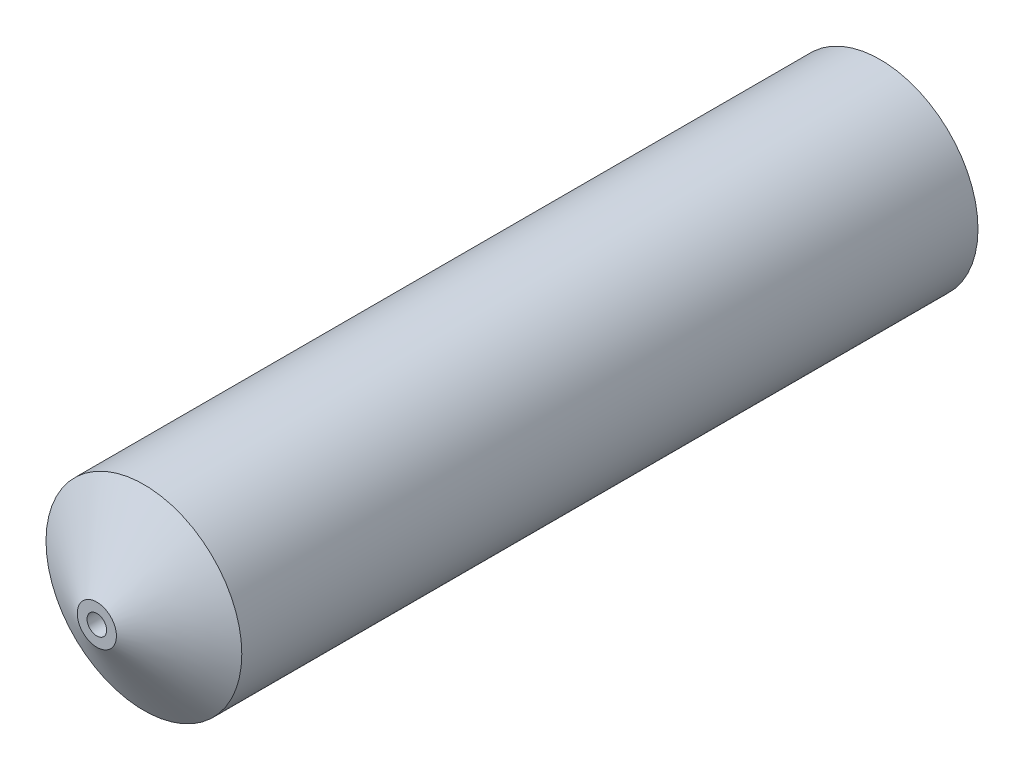
ISO-10303-21;
HEADER;
FILE_DESCRIPTION(('STEP AP214'),'2;1');
FILE_NAME('part.step','',(''),(''),'','','');
FILE_SCHEMA(('AUTOMOTIVE_DESIGN { 1 0 10303 214 1 1 1 1 }'));
ENDSEC;
DATA;
#1=APPLICATION_CONTEXT('core data for automotive mechanical design processes');
#2=APPLICATION_PROTOCOL_DEFINITION('international standard','automotive_design',2000,#1);
#3=PRODUCT_CONTEXT('',#1,'mechanical');
#4=PRODUCT('Part','Part','',(#3));
#5=PRODUCT_RELATED_PRODUCT_CATEGORY('part','',(#4));
#6=PRODUCT_DEFINITION_FORMATION('','',#4);
#7=PRODUCT_DEFINITION_CONTEXT('part definition',#1,'design');
#8=PRODUCT_DEFINITION('design','',#6,#7);
#9=PRODUCT_DEFINITION_SHAPE('','',#8);
#10=(LENGTH_UNIT() NAMED_UNIT(*) SI_UNIT(.MILLI.,.METRE.));
#11=(NAMED_UNIT(*) PLANE_ANGLE_UNIT() SI_UNIT($,.RADIAN.));
#12=(NAMED_UNIT(*) SI_UNIT($,.STERADIAN.) SOLID_ANGLE_UNIT());
#13=UNCERTAINTY_MEASURE_WITH_UNIT(LENGTH_MEASURE(1.E-05),#10,'distance_accuracy_value','');
#14=(GEOMETRIC_REPRESENTATION_CONTEXT(3) GLOBAL_UNCERTAINTY_ASSIGNED_CONTEXT((#13)) GLOBAL_UNIT_ASSIGNED_CONTEXT((#10,
#11,#12)) REPRESENTATION_CONTEXT('',''));
#15=CARTESIAN_POINT('',(0.,0.,0.));
#16=DIRECTION('',(0.,0.,1.));
#17=DIRECTION('',(1.,0.,0.));
#18=AXIS2_PLACEMENT_3D('',#15,#16,#17);
#19=CARTESIAN_POINT('',(0.,0.,20.));
#20=DIRECTION('',(0.,0.,-1.));
#21=DIRECTION('',(-1.,0.,0.));
#22=AXIS2_PLACEMENT_3D('',#19,#20,#21);
#23=CONICAL_SURFACE('',#22,0.500000000000003,1.02974425867665);
#24=CARTESIAN_POINT('',(0.,0.,18.7982787619449));
#25=DIRECTION('',(0.,0.,-1.));
#26=DIRECTION('',(-1.,0.,0.));
#27=AXIS2_PLACEMENT_3D('',#24,#25,#26);
#28=CIRCLE('',#27,2.5);
#29=CARTESIAN_POINT('',(-2.5,0.,18.7982787619449));
#30=VERTEX_POINT('',#29);
#31=EDGE_CURVE('E10',#30,#30,#28,.T.);
#32=ORIENTED_EDGE('',*,*,#31,.F.);
#33=EDGE_LOOP('',(#32));
#34=FACE_BOUND('',#33,.T.);
#35=CARTESIAN_POINT('',(0.,0.,20.));
#36=DIRECTION('',(0.,0.,-1.));
#37=DIRECTION('',(-1.,0.,0.));
#38=AXIS2_PLACEMENT_3D('',#35,#36,#37);
#39=CIRCLE('',#38,0.500000000000003);
#40=CARTESIAN_POINT('',(-0.500000000000003,0.,20.));
#41=VERTEX_POINT('',#40);
#42=EDGE_CURVE('E65',#41,#41,#39,.T.);
#43=ORIENTED_EDGE('',*,*,#42,.T.);
#44=EDGE_LOOP('',(#43));
#45=FACE_BOUND('',#44,.T.);
#46=ADVANCED_FACE('F33',(#34,#45),#23,.T.);
#47=CARTESIAN_POINT('',(0.,0.,0.));
#48=DIRECTION('',(0.,0.,-1.));
#49=DIRECTION('',(-1.,0.,0.));
#50=AXIS2_PLACEMENT_3D('',#47,#48,#49);
#51=CYLINDRICAL_SURFACE('',#50,2.5);
#52=CARTESIAN_POINT('',(0.,0.,0.));
#53=DIRECTION('',(0.,0.,-1.));
#54=DIRECTION('',(-1.,0.,0.));
#55=AXIS2_PLACEMENT_3D('',#52,#53,#54);
#56=CIRCLE('',#55,2.5);
#57=CARTESIAN_POINT('',(-2.5,0.,0.));
#58=VERTEX_POINT('',#57);
#59=EDGE_CURVE('E39',#58,#58,#56,.T.);
#60=ORIENTED_EDGE('',*,*,#59,.F.);
#61=EDGE_LOOP('',(#60));
#62=FACE_BOUND('',#61,.T.);
#63=ORIENTED_EDGE('',*,*,#31,.T.);
#64=EDGE_LOOP('',(#63));
#65=FACE_BOUND('',#64,.T.);
#66=ADVANCED_FACE('F108',(#62,#65),#51,.T.);
#67=CARTESIAN_POINT('',(2.5,0.,0.));
#68=DIRECTION('',(0.,0.,1.));
#69=DIRECTION('',(1.,0.,0.));
#70=AXIS2_PLACEMENT_3D('',#67,#68,#69);
#71=PLANE('',#70);
#72=CARTESIAN_POINT('',(0.,0.,0.));
#73=DIRECTION('',(0.,0.,-1.));
#74=DIRECTION('',(-1.,0.,0.));
#75=AXIS2_PLACEMENT_3D('',#72,#73,#74);
#76=CIRCLE('',#75,1.65);
#77=CARTESIAN_POINT('',(-1.65,0.,0.));
#78=VERTEX_POINT('',#77);
#79=EDGE_CURVE('E43',#78,#78,#76,.T.);
#80=ORIENTED_EDGE('',*,*,#79,.F.);
#81=EDGE_LOOP('',(#80));
#82=FACE_BOUND('',#81,.T.);
#83=ORIENTED_EDGE('',*,*,#59,.T.);
#84=EDGE_LOOP('',(#83));
#85=FACE_BOUND('',#84,.T.);
#86=ADVANCED_FACE('F103',(#82,#85),#71,.F.);
#87=CARTESIAN_POINT('',(0.,0.,0.));
#88=DIRECTION('',(0.,0.,-1.));
#89=DIRECTION('',(-1.,0.,0.));
#90=AXIS2_PLACEMENT_3D('',#87,#88,#89);
#91=CYLINDRICAL_SURFACE('',#90,1.65);
#92=CARTESIAN_POINT('',(0.,0.,4.));
#93=DIRECTION('',(0.,0.,-1.));
#94=DIRECTION('',(-1.,0.,0.));
#95=AXIS2_PLACEMENT_3D('',#92,#93,#94);
#96=CIRCLE('',#95,1.65);
#97=CARTESIAN_POINT('',(-1.65,0.,4.));
#98=VERTEX_POINT('',#97);
#99=EDGE_CURVE('E47',#98,#98,#96,.T.);
#100=ORIENTED_EDGE('',*,*,#99,.F.);
#101=EDGE_LOOP('',(#100));
#102=FACE_BOUND('',#101,.T.);
#103=ORIENTED_EDGE('',*,*,#79,.T.);
#104=EDGE_LOOP('',(#103));
#105=FACE_BOUND('',#104,.T.);
#106=ADVANCED_FACE('F97',(#102,#105),#91,.F.);
#107=CARTESIAN_POINT('',(1.65,0.,4.));
#108=DIRECTION('',(0.,0.,1.));
#109=DIRECTION('',(1.,0.,0.));
#110=AXIS2_PLACEMENT_3D('',#107,#108,#109);
#111=PLANE('',#110);
#112=CARTESIAN_POINT('',(0.,0.,4.));
#113=DIRECTION('',(0.,0.,-1.));
#114=DIRECTION('',(-1.,0.,0.));
#115=AXIS2_PLACEMENT_3D('',#112,#113,#114);
#116=CIRCLE('',#115,1.);
#117=CARTESIAN_POINT('',(-1.,0.,4.));
#118=VERTEX_POINT('',#117);
#119=EDGE_CURVE('E53',#118,#118,#116,.T.);
#120=ORIENTED_EDGE('',*,*,#119,.F.);
#121=EDGE_LOOP('',(#120));
#122=FACE_BOUND('',#121,.T.);
#123=ORIENTED_EDGE('',*,*,#99,.T.);
#124=EDGE_LOOP('',(#123));
#125=FACE_BOUND('',#124,.T.);
#126=ADVANCED_FACE('F91',(#122,#125),#111,.F.);
#127=CARTESIAN_POINT('',(0.,0.,0.));
#128=DIRECTION('',(0.,0.,-1.));
#129=DIRECTION('',(-1.,0.,0.));
#130=AXIS2_PLACEMENT_3D('',#127,#128,#129);
#131=CYLINDRICAL_SURFACE('',#130,1.);
#132=CARTESIAN_POINT('',(0.,0.,18.9493545357293));
#133=DIRECTION('',(0.,0.,-1.));
#134=DIRECTION('',(-1.,0.,0.));
#135=AXIS2_PLACEMENT_3D('',#132,#133,#134);
#136=CIRCLE('',#135,1.);
#137=CARTESIAN_POINT('',(-1.,0.,18.9493545357293));
#138=VERTEX_POINT('',#137);
#139=EDGE_CURVE('E56',#138,#138,#136,.T.);
#140=ORIENTED_EDGE('',*,*,#139,.F.);
#141=EDGE_LOOP('',(#140));
#142=FACE_BOUND('',#141,.T.);
#143=ORIENTED_EDGE('',*,*,#119,.T.);
#144=EDGE_LOOP('',(#143));
#145=FACE_BOUND('',#144,.T.);
#146=ADVANCED_FACE('F85',(#142,#145),#131,.F.);
#147=CARTESIAN_POINT('',(0.,0.,18.9493545357293));
#148=DIRECTION('',(0.,0.,-1.));
#149=DIRECTION('',(-1.,0.,0.));
#150=AXIS2_PLACEMENT_3D('',#147,#148,#149);
#151=CONICAL_SURFACE('',#150,1.,1.02974425867665);
#152=CARTESIAN_POINT('',(0.,0.,19.4));
#153=DIRECTION('',(0.,0.,-1.));
#154=DIRECTION('',(-1.,0.,0.));
#155=AXIS2_PLACEMENT_3D('',#152,#153,#154);
#156=CIRCLE('',#155,0.250000000000002);
#157=CARTESIAN_POINT('',(-0.250000000000002,0.,19.4));
#158=VERTEX_POINT('',#157);
#159=EDGE_CURVE('E59',#158,#158,#156,.T.);
#160=ORIENTED_EDGE('',*,*,#159,.F.);
#161=EDGE_LOOP('',(#160));
#162=FACE_BOUND('',#161,.T.);
#163=ORIENTED_EDGE('',*,*,#139,.T.);
#164=EDGE_LOOP('',(#163));
#165=FACE_BOUND('',#164,.T.);
#166=ADVANCED_FACE('F79',(#162,#165),#151,.F.);
#167=CARTESIAN_POINT('',(0.,0.,0.));
#168=DIRECTION('',(0.,0.,-1.));
#169=DIRECTION('',(-1.,0.,0.));
#170=AXIS2_PLACEMENT_3D('',#167,#168,#169);
#171=CYLINDRICAL_SURFACE('',#170,0.250000000000002);
#172=CARTESIAN_POINT('',(0.,0.,20.));
#173=DIRECTION('',(0.,0.,-1.));
#174=DIRECTION('',(-1.,0.,0.));
#175=AXIS2_PLACEMENT_3D('',#172,#173,#174);
#176=CIRCLE('',#175,0.250000000000002);
#177=CARTESIAN_POINT('',(-0.250000000000002,0.,20.));
#178=VERTEX_POINT('',#177);
#179=EDGE_CURVE('E62',#178,#178,#176,.T.);
#180=ORIENTED_EDGE('',*,*,#179,.F.);
#181=EDGE_LOOP('',(#180));
#182=FACE_BOUND('',#181,.T.);
#183=ORIENTED_EDGE('',*,*,#159,.T.);
#184=EDGE_LOOP('',(#183));
#185=FACE_BOUND('',#184,.T.);
#186=ADVANCED_FACE('F73',(#182,#185),#171,.F.);
#187=CARTESIAN_POINT('',(0.250000000000002,0.,20.));
#188=DIRECTION('',(0.,0.,-1.));
#189=DIRECTION('',(-1.,0.,0.));
#190=AXIS2_PLACEMENT_3D('',#187,#188,#189);
#191=PLANE('',#190);
#192=ORIENTED_EDGE('',*,*,#42,.F.);
#193=EDGE_LOOP('',(#192));
#194=FACE_BOUND('',#193,.T.);
#195=ORIENTED_EDGE('',*,*,#179,.T.);
#196=EDGE_LOOP('',(#195));
#197=FACE_BOUND('',#196,.T.);
#198=ADVANCED_FACE('F70',(#194,#197),#191,.F.);
#199=CLOSED_SHELL('',(#46,#66,#86,#106,#126,#146,#166,#186,#198));
#200=MANIFOLD_SOLID_BREP('B2',#199);
#201=ADVANCED_BREP_SHAPE_REPRESENTATION('',(#18,#200),#14);
#202=SHAPE_DEFINITION_REPRESENTATION(#9,#201);
ENDSEC;
END-ISO-10303-21;
